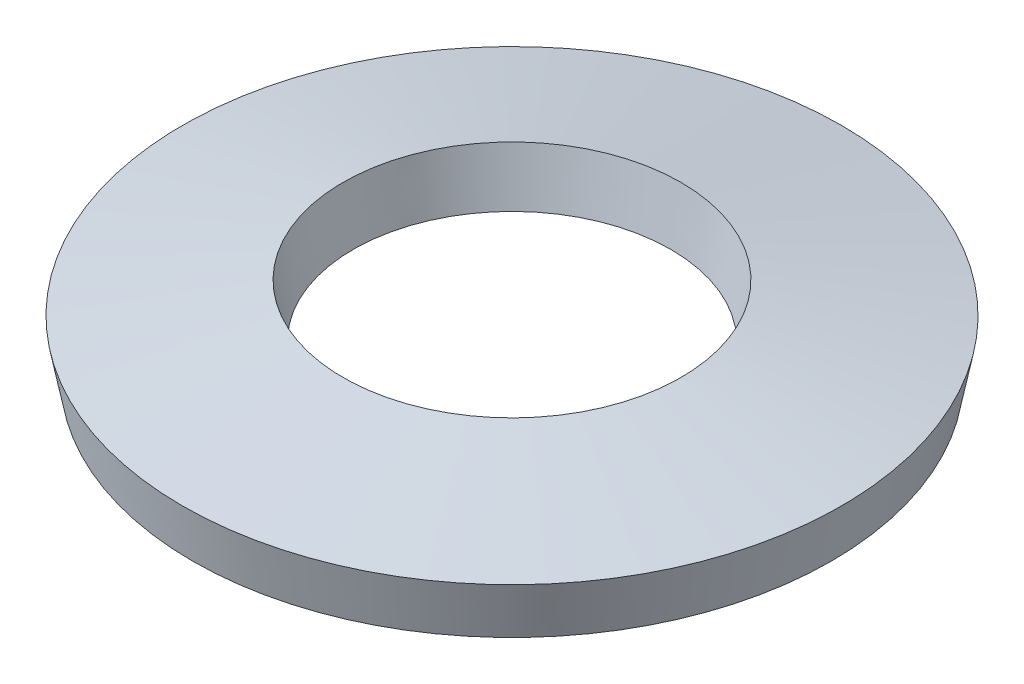
ISO-10303-21;
HEADER;
FILE_DESCRIPTION(('STEP AP214'),'2;1');
FILE_NAME('part.step','',(''),(''),'','','');
FILE_SCHEMA(('AUTOMOTIVE_DESIGN { 1 0 10303 214 1 1 1 1 }'));
ENDSEC;
DATA;
#1=APPLICATION_CONTEXT('core data for automotive mechanical design processes');
#2=APPLICATION_PROTOCOL_DEFINITION('international standard','automotive_design',2000,#1);
#3=PRODUCT_CONTEXT('',#1,'mechanical');
#4=PRODUCT('Part','Part','',(#3));
#5=PRODUCT_RELATED_PRODUCT_CATEGORY('part','',(#4));
#6=PRODUCT_DEFINITION_FORMATION('','',#4);
#7=PRODUCT_DEFINITION_CONTEXT('part definition',#1,'design');
#8=PRODUCT_DEFINITION('design','',#6,#7);
#9=PRODUCT_DEFINITION_SHAPE('','',#8);
#10=(LENGTH_UNIT() NAMED_UNIT(*) SI_UNIT(.MILLI.,.METRE.));
#11=(NAMED_UNIT(*) PLANE_ANGLE_UNIT() SI_UNIT($,.RADIAN.));
#12=(NAMED_UNIT(*) SI_UNIT($,.STERADIAN.) SOLID_ANGLE_UNIT());
#13=UNCERTAINTY_MEASURE_WITH_UNIT(LENGTH_MEASURE(1.E-05),#10,'distance_accuracy_value','');
#14=(GEOMETRIC_REPRESENTATION_CONTEXT(3) GLOBAL_UNCERTAINTY_ASSIGNED_CONTEXT((#13)) GLOBAL_UNIT_ASSIGNED_CONTEXT((#10,
#11,#12)) REPRESENTATION_CONTEXT('',''));
#15=CARTESIAN_POINT('',(0.,0.,0.));
#16=DIRECTION('',(0.,0.,1.));
#17=DIRECTION('',(1.,0.,0.));
#18=AXIS2_PLACEMENT_3D('',#15,#16,#17);
#19=CARTESIAN_POINT('',(0.,0.,0.));
#20=DIRECTION('',(0.,1.,0.));
#21=DIRECTION('',(0.,0.,1.));
#22=AXIS2_PLACEMENT_3D('',#19,#20,#21);
#23=CONICAL_SURFACE('',#22,5.32974658913634,0.190317280759798);
#24=CARTESIAN_POINT('',(0.,0.88374983795715,0.));
#25=DIRECTION('',(0.,-1.,0.));
#26=DIRECTION('',(0.,0.,-1.));
#27=AXIS2_PLACEMENT_3D('',#24,#25,#26);
#28=CIRCLE('',#27,5.5);
#29=CARTESIAN_POINT('',(0.,0.88374983795715,-5.5));
#30=VERTEX_POINT('',#29);
#31=EDGE_CURVE('E46',#30,#30,#28,.T.);
#32=ORIENTED_EDGE('',*,*,#31,.T.);
#33=EDGE_LOOP('',(#32));
#34=FACE_BOUND('',#33,.T.);
#35=CARTESIAN_POINT('',(0.,0.,0.));
#36=DIRECTION('',(0.,-1.,0.));
#37=DIRECTION('',(0.,0.,-1.));
#38=AXIS2_PLACEMENT_3D('',#35,#36,#37);
#39=CIRCLE('',#38,5.32974658913634);
#40=CARTESIAN_POINT('',(0.,0.,-5.32974658913634));
#41=VERTEX_POINT('',#40);
#42=EDGE_CURVE('E10',#41,#41,#39,.T.);
#43=ORIENTED_EDGE('',*,*,#42,.F.);
#44=EDGE_LOOP('',(#43));
#45=FACE_BOUND('',#44,.T.);
#46=ADVANCED_FACE('F32',(#34,#45),#23,.T.);
#47=CARTESIAN_POINT('',(0.,0.51625016204285,0.));
#48=DIRECTION('',(0.,-1.,0.));
#49=DIRECTION('',(0.,0.,-1.));
#50=AXIS2_PLACEMENT_3D('',#47,#48,#49);
#51=CONICAL_SURFACE('',#50,2.65,1.3804790460351);
#52=ORIENTED_EDGE('',*,*,#42,.T.);
#53=EDGE_LOOP('',(#52));
#54=FACE_BOUND('',#53,.T.);
#55=CARTESIAN_POINT('',(0.,0.51625016204285,0.));
#56=DIRECTION('',(0.,-1.,0.));
#57=DIRECTION('',(0.,0.,-1.));
#58=AXIS2_PLACEMENT_3D('',#55,#56,#57);
#59=CIRCLE('',#58,2.65);
#60=CARTESIAN_POINT('',(0.,0.51625016204285,-2.65));
#61=VERTEX_POINT('',#60);
#62=EDGE_CURVE('E38',#61,#61,#59,.T.);
#63=ORIENTED_EDGE('',*,*,#62,.F.);
#64=EDGE_LOOP('',(#63));
#65=FACE_BOUND('',#64,.T.);
#66=ADVANCED_FACE('F62',(#54,#65),#51,.F.);
#67=CARTESIAN_POINT('',(0.,1.4,0.));
#68=DIRECTION('',(0.,1.,0.));
#69=DIRECTION('',(0.,0.,1.));
#70=AXIS2_PLACEMENT_3D('',#67,#68,#69);
#71=CONICAL_SURFACE('',#70,2.82025341086366,0.190317280759797);
#72=ORIENTED_EDGE('',*,*,#62,.T.);
#73=EDGE_LOOP('',(#72));
#74=FACE_BOUND('',#73,.T.);
#75=CARTESIAN_POINT('',(0.,1.4,0.));
#76=DIRECTION('',(0.,-1.,0.));
#77=DIRECTION('',(0.,0.,-1.));
#78=AXIS2_PLACEMENT_3D('',#75,#76,#77);
#79=CIRCLE('',#78,2.82025341086366);
#80=CARTESIAN_POINT('',(0.,1.4,-2.82025341086366));
#81=VERTEX_POINT('',#80);
#82=EDGE_CURVE('E42',#81,#81,#79,.T.);
#83=ORIENTED_EDGE('',*,*,#82,.F.);
#84=EDGE_LOOP('',(#83));
#85=FACE_BOUND('',#84,.T.);
#86=ADVANCED_FACE('F56',(#74,#85),#71,.F.);
#87=CARTESIAN_POINT('',(0.,0.88374983795715,0.));
#88=DIRECTION('',(0.,-1.,0.));
#89=DIRECTION('',(0.,0.,-1.));
#90=AXIS2_PLACEMENT_3D('',#87,#88,#89);
#91=CONICAL_SURFACE('',#90,5.5,1.3804790460351);
#92=ORIENTED_EDGE('',*,*,#82,.T.);
#93=EDGE_LOOP('',(#92));
#94=FACE_BOUND('',#93,.T.);
#95=ORIENTED_EDGE('',*,*,#31,.F.);
#96=EDGE_LOOP('',(#95));
#97=FACE_BOUND('',#96,.T.);
#98=ADVANCED_FACE('F54',(#94,#97),#91,.T.);
#99=CLOSED_SHELL('',(#46,#66,#86,#98));
#100=MANIFOLD_SOLID_BREP('B2',#99);
#101=ADVANCED_BREP_SHAPE_REPRESENTATION('',(#18,#100),#14);
#102=SHAPE_DEFINITION_REPRESENTATION(#9,#101);
ENDSEC;
END-ISO-10303-21;
